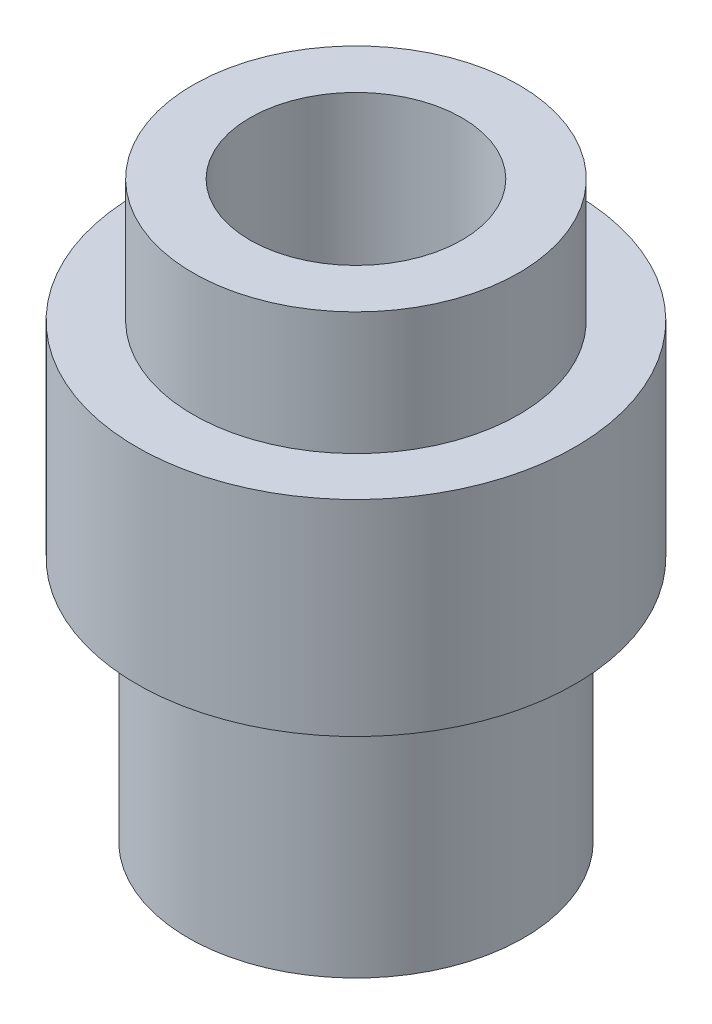
ISO-10303-21;
HEADER;
FILE_DESCRIPTION(('STEP AP214'),'2;1');
FILE_NAME('part.step','',(''),(''),'','','');
FILE_SCHEMA(('AUTOMOTIVE_DESIGN { 1 0 10303 214 1 1 1 1 }'));
ENDSEC;
DATA;
#1=APPLICATION_CONTEXT('core data for automotive mechanical design processes');
#2=APPLICATION_PROTOCOL_DEFINITION('international standard','automotive_design',2000,#1);
#3=PRODUCT_CONTEXT('',#1,'mechanical');
#4=PRODUCT('Part','Part','',(#3));
#5=PRODUCT_RELATED_PRODUCT_CATEGORY('part','',(#4));
#6=PRODUCT_DEFINITION_FORMATION('','',#4);
#7=PRODUCT_DEFINITION_CONTEXT('part definition',#1,'design');
#8=PRODUCT_DEFINITION('design','',#6,#7);
#9=PRODUCT_DEFINITION_SHAPE('','',#8);
#10=(LENGTH_UNIT() NAMED_UNIT(*) SI_UNIT(.MILLI.,.METRE.));
#11=(NAMED_UNIT(*) PLANE_ANGLE_UNIT() SI_UNIT($,.RADIAN.));
#12=(NAMED_UNIT(*) SI_UNIT($,.STERADIAN.) SOLID_ANGLE_UNIT());
#13=UNCERTAINTY_MEASURE_WITH_UNIT(LENGTH_MEASURE(1.E-05),#10,'distance_accuracy_value','');
#14=(GEOMETRIC_REPRESENTATION_CONTEXT(3) GLOBAL_UNCERTAINTY_ASSIGNED_CONTEXT((#13)) GLOBAL_UNIT_ASSIGNED_CONTEXT((#10,
#11,#12)) REPRESENTATION_CONTEXT('',''));
#15=CARTESIAN_POINT('',(0.,0.,0.));
#16=DIRECTION('',(0.,0.,1.));
#17=DIRECTION('',(1.,0.,0.));
#18=AXIS2_PLACEMENT_3D('',#15,#16,#17);
#19=CARTESIAN_POINT('',(3.76014538790642,0.,0.));
#20=DIRECTION('',(0.,-1.,0.));
#21=DIRECTION('',(0.,0.,-1.));
#22=AXIS2_PLACEMENT_3D('',#19,#20,#21);
#23=PLANE('',#22);
#24=CARTESIAN_POINT('',(0.,0.,0.));
#25=DIRECTION('',(0.,-1.,0.));
#26=DIRECTION('',(0.,0.,-1.));
#27=AXIS2_PLACEMENT_3D('',#24,#25,#26);
#28=CIRCLE('',#27,3.76014538790642);
#29=CARTESIAN_POINT('',(0.,0.,-3.76014538790642));
#30=VERTEX_POINT('',#29);
#31=EDGE_CURVE('E11',#30,#30,#28,.T.);
#32=ORIENTED_EDGE('',*,*,#31,.T.);
#33=EDGE_LOOP('',(#32));
#34=FACE_BOUND('',#33,.T.);
#35=ADVANCED_FACE('F43',(#34),#23,.T.);
#36=CARTESIAN_POINT('',(0.,0.,0.));
#37=DIRECTION('',(0.,-1.,0.));
#38=DIRECTION('',(0.,0.,-1.));
#39=AXIS2_PLACEMENT_3D('',#36,#37,#38);
#40=CYLINDRICAL_SURFACE('',#39,3.76014538790642);
#41=CARTESIAN_POINT('',(0.,5.5,0.));
#42=DIRECTION('',(0.,-1.,0.));
#43=DIRECTION('',(0.,0.,-1.));
#44=AXIS2_PLACEMENT_3D('',#41,#42,#43);
#45=CIRCLE('',#44,3.76014538790642);
#46=CARTESIAN_POINT('',(0.,5.5,-3.76014538790642));
#47=VERTEX_POINT('',#46);
#48=EDGE_CURVE('E49',#47,#47,#45,.T.);
#49=ORIENTED_EDGE('',*,*,#48,.T.);
#50=EDGE_LOOP('',(#49));
#51=FACE_BOUND('',#50,.T.);
#52=ORIENTED_EDGE('',*,*,#31,.F.);
#53=EDGE_LOOP('',(#52));
#54=FACE_BOUND('',#53,.T.);
#55=ADVANCED_FACE('F80',(#51,#54),#40,.T.);
#56=CARTESIAN_POINT('',(3.76014538790642,5.5,0.));
#57=DIRECTION('',(0.,-1.,0.));
#58=DIRECTION('',(0.,0.,-1.));
#59=AXIS2_PLACEMENT_3D('',#56,#57,#58);
#60=PLANE('',#59);
#61=CARTESIAN_POINT('',(0.,5.5,0.));
#62=DIRECTION('',(0.,-1.,0.));
#63=DIRECTION('',(0.,0.,-1.));
#64=AXIS2_PLACEMENT_3D('',#61,#62,#63);
#65=CIRCLE('',#64,4.90999999999999);
#66=CARTESIAN_POINT('',(0.,5.5,-4.90999999999999));
#67=VERTEX_POINT('',#66);
#68=EDGE_CURVE('E75',#67,#67,#65,.T.);
#69=ORIENTED_EDGE('',*,*,#68,.T.);
#70=EDGE_LOOP('',(#69));
#71=FACE_BOUND('',#70,.T.);
#72=ORIENTED_EDGE('',*,*,#48,.F.);
#73=EDGE_LOOP('',(#72));
#74=FACE_BOUND('',#73,.T.);
#75=ADVANCED_FACE('F83',(#71,#74),#60,.T.);
#76=CARTESIAN_POINT('',(0.,0.,0.));
#77=DIRECTION('',(0.,-1.,0.));
#78=DIRECTION('',(0.,0.,-1.));
#79=AXIS2_PLACEMENT_3D('',#76,#77,#78);
#80=CYLINDRICAL_SURFACE('',#79,4.90999999999999);
#81=CARTESIAN_POINT('',(0.,10.1,0.));
#82=DIRECTION('',(0.,-1.,0.));
#83=DIRECTION('',(0.,0.,-1.));
#84=AXIS2_PLACEMENT_3D('',#81,#82,#83);
#85=CIRCLE('',#84,4.90999999999999);
#86=CARTESIAN_POINT('',(0.,10.1,-4.90999999999999));
#87=VERTEX_POINT('',#86);
#88=EDGE_CURVE('E72',#87,#87,#85,.T.);
#89=ORIENTED_EDGE('',*,*,#88,.T.);
#90=EDGE_LOOP('',(#89));
#91=FACE_BOUND('',#90,.T.);
#92=ORIENTED_EDGE('',*,*,#68,.F.);
#93=EDGE_LOOP('',(#92));
#94=FACE_BOUND('',#93,.T.);
#95=ADVANCED_FACE('F85',(#91,#94),#80,.T.);
#96=CARTESIAN_POINT('',(4.90999999999999,10.1,0.));
#97=DIRECTION('',(0.,1.,0.));
#98=DIRECTION('',(0.,0.,1.));
#99=AXIS2_PLACEMENT_3D('',#96,#97,#98);
#100=PLANE('',#99);
#101=CARTESIAN_POINT('',(0.,10.1,0.));
#102=DIRECTION('',(0.,-1.,0.));
#103=DIRECTION('',(0.,0.,-1.));
#104=AXIS2_PLACEMENT_3D('',#101,#102,#103);
#105=CIRCLE('',#104,3.65);
#106=CARTESIAN_POINT('',(0.,10.1,-3.65));
#107=VERTEX_POINT('',#106);
#108=EDGE_CURVE('E69',#107,#107,#105,.T.);
#109=ORIENTED_EDGE('',*,*,#108,.T.);
#110=EDGE_LOOP('',(#109));
#111=FACE_BOUND('',#110,.T.);
#112=ORIENTED_EDGE('',*,*,#88,.F.);
#113=EDGE_LOOP('',(#112));
#114=FACE_BOUND('',#113,.T.);
#115=ADVANCED_FACE('F92',(#111,#114),#100,.T.);
#116=CARTESIAN_POINT('',(0.,0.,0.));
#117=DIRECTION('',(0.,-1.,0.));
#118=DIRECTION('',(0.,0.,-1.));
#119=AXIS2_PLACEMENT_3D('',#116,#117,#118);
#120=CYLINDRICAL_SURFACE('',#119,3.65);
#121=CARTESIAN_POINT('',(0.,12.85,0.));
#122=DIRECTION('',(0.,-1.,0.));
#123=DIRECTION('',(0.,0.,-1.));
#124=AXIS2_PLACEMENT_3D('',#121,#122,#123);
#125=CIRCLE('',#124,3.65);
#126=CARTESIAN_POINT('',(0.,12.85,-3.65));
#127=VERTEX_POINT('',#126);
#128=EDGE_CURVE('E64',#127,#127,#125,.T.);
#129=ORIENTED_EDGE('',*,*,#128,.T.);
#130=EDGE_LOOP('',(#129));
#131=FACE_BOUND('',#130,.T.);
#132=ORIENTED_EDGE('',*,*,#108,.F.);
#133=EDGE_LOOP('',(#132));
#134=FACE_BOUND('',#133,.T.);
#135=ADVANCED_FACE('F125',(#131,#134),#120,.T.);
#136=CARTESIAN_POINT('',(2.375,12.85,0.));
#137=DIRECTION('',(0.,1.,0.));
#138=DIRECTION('',(0.,0.,1.));
#139=AXIS2_PLACEMENT_3D('',#136,#137,#138);
#140=PLANE('',#139);
#141=CARTESIAN_POINT('',(0.,12.85,0.));
#142=DIRECTION('',(0.,-1.,0.));
#143=DIRECTION('',(0.,0.,-1.));
#144=AXIS2_PLACEMENT_3D('',#141,#142,#143);
#145=CIRCLE('',#144,2.375);
#146=CARTESIAN_POINT('',(0.,12.85,-2.375));
#147=VERTEX_POINT('',#146);
#148=EDGE_CURVE('E61',#147,#147,#145,.T.);
#149=ORIENTED_EDGE('',*,*,#148,.T.);
#150=EDGE_LOOP('',(#149));
#151=FACE_BOUND('',#150,.T.);
#152=ORIENTED_EDGE('',*,*,#128,.F.);
#153=EDGE_LOOP('',(#152));
#154=FACE_BOUND('',#153,.T.);
#155=ADVANCED_FACE('F135',(#151,#154),#140,.T.);
#156=CARTESIAN_POINT('',(0.,0.,0.));
#157=DIRECTION('',(0.,-1.,0.));
#158=DIRECTION('',(0.,0.,-1.));
#159=AXIS2_PLACEMENT_3D('',#156,#157,#158);
#160=CYLINDRICAL_SURFACE('',#159,2.375);
#161=CARTESIAN_POINT('',(0.,3.42704397019047,0.));
#162=DIRECTION('',(0.,-1.,0.));
#163=DIRECTION('',(0.,0.,-1.));
#164=AXIS2_PLACEMENT_3D('',#161,#162,#163);
#165=CIRCLE('',#164,2.375);
#166=CARTESIAN_POINT('',(0.,3.42704397019047,-2.375));
#167=VERTEX_POINT('',#166);
#168=EDGE_CURVE('E59',#167,#167,#165,.T.);
#169=ORIENTED_EDGE('',*,*,#168,.T.);
#170=EDGE_LOOP('',(#169));
#171=FACE_BOUND('',#170,.T.);
#172=ORIENTED_EDGE('',*,*,#148,.F.);
#173=EDGE_LOOP('',(#172));
#174=FACE_BOUND('',#173,.T.);
#175=ADVANCED_FACE('F55',(#171,#174),#160,.F.);
#176=CARTESIAN_POINT('',(0.,3.42704397019047,0.));
#177=DIRECTION('',(0.,1.,0.));
#178=DIRECTION('',(0.,0.,1.));
#179=AXIS2_PLACEMENT_3D('',#176,#177,#178);
#180=CONICAL_SURFACE('',#179,2.375,1.02974425867665);
#181=CARTESIAN_POINT('',(0.,2.,0.));
#182=VERTEX_POINT('',#181);
#183=VERTEX_LOOP('',#182);
#184=FACE_BOUND('',#183,.T.);
#185=ORIENTED_EDGE('',*,*,#168,.F.);
#186=EDGE_LOOP('',(#185));
#187=FACE_BOUND('',#186,.T.);
#188=ADVANCED_FACE('F52',(#184,#187),#180,.F.);
#189=CLOSED_SHELL('',(#35,#55,#75,#95,#115,#135,#155,#175,#188));
#190=MANIFOLD_SOLID_BREP('B2',#189);
#191=ADVANCED_BREP_SHAPE_REPRESENTATION('',(#18,#190),#14);
#192=SHAPE_DEFINITION_REPRESENTATION(#9,#191);
ENDSEC;
END-ISO-10303-21;
